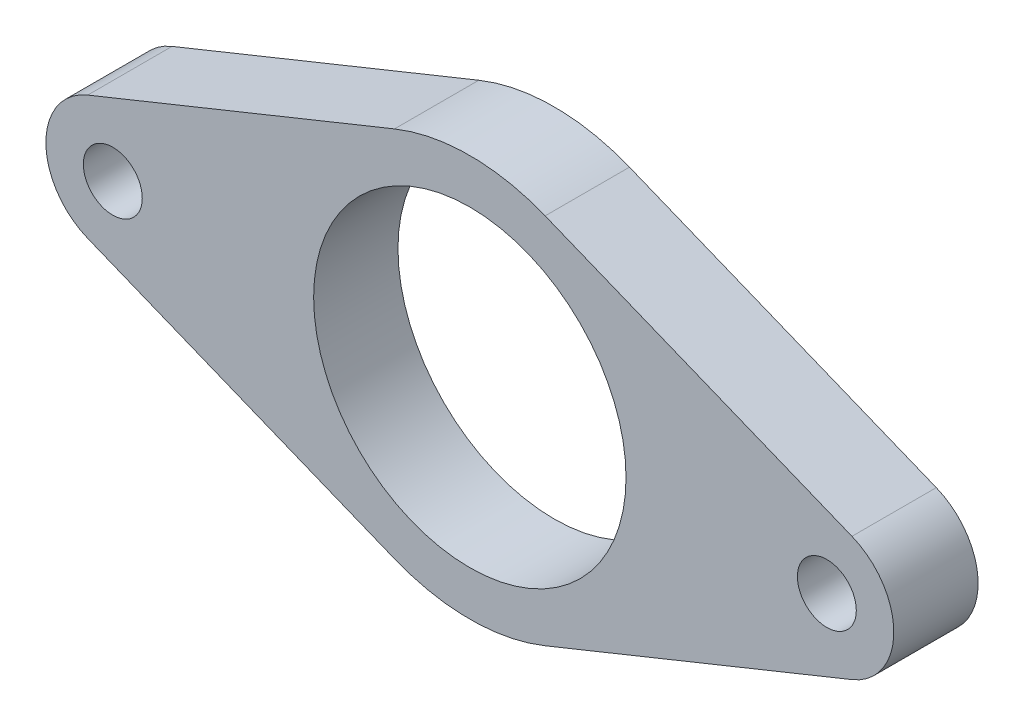
ISO-10303-21;
HEADER;
FILE_DESCRIPTION(('STEP AP214'),'2;1');
FILE_NAME('part.step','',(''),(''),'','','');
FILE_SCHEMA(('AUTOMOTIVE_DESIGN { 1 0 10303 214 1 1 1 1 }'));
ENDSEC;
DATA;
#1=APPLICATION_CONTEXT('core data for automotive mechanical design processes');
#2=APPLICATION_PROTOCOL_DEFINITION('international standard','automotive_design',2000,#1);
#3=PRODUCT_CONTEXT('',#1,'mechanical');
#4=PRODUCT('Part','Part','',(#3));
#5=PRODUCT_RELATED_PRODUCT_CATEGORY('part','',(#4));
#6=PRODUCT_DEFINITION_FORMATION('','',#4);
#7=PRODUCT_DEFINITION_CONTEXT('part definition',#1,'design');
#8=PRODUCT_DEFINITION('design','',#6,#7);
#9=PRODUCT_DEFINITION_SHAPE('','',#8);
#10=(LENGTH_UNIT() NAMED_UNIT(*) SI_UNIT(.MILLI.,.METRE.));
#11=(NAMED_UNIT(*) PLANE_ANGLE_UNIT() SI_UNIT($,.RADIAN.));
#12=(NAMED_UNIT(*) SI_UNIT($,.STERADIAN.) SOLID_ANGLE_UNIT());
#13=UNCERTAINTY_MEASURE_WITH_UNIT(LENGTH_MEASURE(1.E-05),#10,'distance_accuracy_value','');
#14=(GEOMETRIC_REPRESENTATION_CONTEXT(3) GLOBAL_UNCERTAINTY_ASSIGNED_CONTEXT((#13)) GLOBAL_UNIT_ASSIGNED_CONTEXT((#10,
#11,#12)) REPRESENTATION_CONTEXT('',''));
#15=CARTESIAN_POINT('',(0.,0.,0.));
#16=DIRECTION('',(0.,0.,1.));
#17=DIRECTION('',(1.,0.,0.));
#18=AXIS2_PLACEMENT_3D('',#15,#16,#17);
#19=CARTESIAN_POINT('',(0.,0.,3.));
#20=DIRECTION('',(0.,0.,1.));
#21=DIRECTION('',(1.,0.,0.));
#22=AXIS2_PLACEMENT_3D('',#19,#20,#21);
#23=PLANE('',#22);
#24=CARTESIAN_POINT('',(0.,0.,3.));
#25=DIRECTION('',(0.,0.,-1.));
#26=DIRECTION('',(-1.,0.,0.));
#27=AXIS2_PLACEMENT_3D('',#24,#25,#26);
#28=CIRCLE('',#27,11.1125);
#29=CARTESIAN_POINT('',(-11.1125,0.,3.));
#30=VERTEX_POINT('',#29);
#31=EDGE_CURVE('E137',#30,#30,#28,.T.);
#32=ORIENTED_EDGE('',*,*,#31,.T.);
#33=EDGE_LOOP('',(#32));
#34=FACE_BOUND('',#33,.T.);
#35=DIRECTION('',(-0.927024810886958,0.375,0.));
#36=VECTOR('',#35,1.);
#37=CARTESIAN_POINT('',(-5.3578125,-13.2448669855474,3.));
#38=LINE('',#37,#36);
#39=CARTESIAN_POINT('',(-27.1859375,-4.41495566184915,3.));
#40=VERTEX_POINT('',#39);
#41=CARTESIAN_POINT('',(-5.3578125,-13.2448669855474,3.));
#42=VERTEX_POINT('',#41);
#43=EDGE_CURVE('E110',#40,#42,#38,.F.);
#44=ORIENTED_EDGE('',*,*,#43,.T.);
#45=CARTESIAN_POINT('',(0.,0.,3.));
#46=DIRECTION('',(0.,0.,-1.));
#47=DIRECTION('',(-1.,0.,0.));
#48=AXIS2_PLACEMENT_3D('',#45,#46,#47);
#49=CIRCLE('',#48,14.2875);
#50=CARTESIAN_POINT('',(5.35781250000001,-13.2448669855474,3.));
#51=VERTEX_POINT('',#50);
#52=EDGE_CURVE('E112',#51,#42,#49,.T.);
#53=ORIENTED_EDGE('',*,*,#52,.F.);
#54=DIRECTION('',(-0.927024810886958,-0.375,0.));
#55=VECTOR('',#54,1.);
#56=CARTESIAN_POINT('',(5.35781250000001,-13.2448669855474,3.));
#57=LINE('',#56,#55);
#58=CARTESIAN_POINT('',(27.1859375,-4.41495566184913,3.));
#59=VERTEX_POINT('',#58);
#60=EDGE_CURVE('E86',#51,#59,#57,.F.);
#61=ORIENTED_EDGE('',*,*,#60,.T.);
#62=CARTESIAN_POINT('',(25.4,0.,3.));
#63=DIRECTION('',(0.,0.,-1.));
#64=DIRECTION('',(-1.,0.,0.));
#65=AXIS2_PLACEMENT_3D('',#62,#63,#64);
#66=CIRCLE('',#65,4.7625);
#67=CARTESIAN_POINT('',(27.1859375,4.41495566184915,3.));
#68=VERTEX_POINT('',#67);
#69=EDGE_CURVE('E80',#68,#59,#66,.T.);
#70=ORIENTED_EDGE('',*,*,#69,.F.);
#71=DIRECTION('',(0.927024810886958,-0.375,0.));
#72=VECTOR('',#71,1.);
#73=CARTESIAN_POINT('',(5.3578125,13.2448669855474,3.));
#74=LINE('',#73,#72);
#75=CARTESIAN_POINT('',(5.35781249999999,13.2448669855474,3.));
#76=VERTEX_POINT('',#75);
#77=EDGE_CURVE('E84',#68,#76,#74,.F.);
#78=ORIENTED_EDGE('',*,*,#77,.T.);
#79=CARTESIAN_POINT('',(0.,0.,3.));
#80=DIRECTION('',(0.,0.,-1.));
#81=DIRECTION('',(-1.,0.,0.));
#82=AXIS2_PLACEMENT_3D('',#79,#80,#81);
#83=CIRCLE('',#82,14.2875);
#84=CARTESIAN_POINT('',(-5.3578125,13.2448669855474,3.));
#85=VERTEX_POINT('',#84);
#86=EDGE_CURVE('E99',#85,#76,#83,.T.);
#87=ORIENTED_EDGE('',*,*,#86,.F.);
#88=DIRECTION('',(0.927024810886958,0.375,0.));
#89=VECTOR('',#88,1.);
#90=CARTESIAN_POINT('',(-5.3578125,13.2448669855474,3.));
#91=LINE('',#90,#89);
#92=CARTESIAN_POINT('',(-27.1859375,4.41495566184913,3.));
#93=VERTEX_POINT('',#92);
#94=EDGE_CURVE('E114',#85,#93,#91,.F.);
#95=ORIENTED_EDGE('',*,*,#94,.T.);
#96=CARTESIAN_POINT('',(-25.4,0.,3.));
#97=DIRECTION('',(0.,0.,-1.));
#98=DIRECTION('',(-1.,0.,0.));
#99=AXIS2_PLACEMENT_3D('',#96,#97,#98);
#100=CIRCLE('',#99,4.7625);
#101=EDGE_CURVE('E142',#40,#93,#100,.T.);
#102=ORIENTED_EDGE('',*,*,#101,.F.);
#103=EDGE_LOOP('',(#44,#53,#61,#70,#78,#87,#95,#102));
#104=FACE_BOUND('',#103,.T.);
#105=CARTESIAN_POINT('',(25.4,0.,3.));
#106=DIRECTION('',(0.,0.,1.));
#107=DIRECTION('',(1.,0.,0.));
#108=AXIS2_PLACEMENT_3D('',#105,#106,#107);
#109=CIRCLE('',#108,2.09549999999999);
#110=CARTESIAN_POINT('',(27.4955,0.,3.));
#111=VERTEX_POINT('',#110);
#112=EDGE_CURVE('E92',#111,#111,#109,.F.);
#113=ORIENTED_EDGE('',*,*,#112,.T.);
#114=EDGE_LOOP('',(#113));
#115=FACE_BOUND('',#114,.T.);
#116=CARTESIAN_POINT('',(-25.4,0.,3.));
#117=DIRECTION('',(0.,0.,1.));
#118=DIRECTION('',(1.,0.,0.));
#119=AXIS2_PLACEMENT_3D('',#116,#117,#118);
#120=CIRCLE('',#119,2.09549999999999);
#121=CARTESIAN_POINT('',(-23.3045,0.,3.));
#122=VERTEX_POINT('',#121);
#123=EDGE_CURVE('E19',#122,#122,#120,.F.);
#124=ORIENTED_EDGE('',*,*,#123,.T.);
#125=EDGE_LOOP('',(#124));
#126=FACE_BOUND('',#125,.T.);
#127=ADVANCED_FACE('F16',(#34,#104,#115,#126),#23,.T.);
#128=CARTESIAN_POINT('',(-25.4,0.,3.));
#129=DIRECTION('',(0.,0.,1.));
#130=DIRECTION('',(1.,0.,0.));
#131=AXIS2_PLACEMENT_3D('',#128,#129,#130);
#132=CYLINDRICAL_SURFACE('',#131,2.09549999999999);
#133=CARTESIAN_POINT('',(-25.4,0.,-3.));
#134=DIRECTION('',(0.,0.,1.));
#135=DIRECTION('',(1.,0.,0.));
#136=AXIS2_PLACEMENT_3D('',#133,#134,#135);
#137=CIRCLE('',#136,2.09549999999999);
#138=CARTESIAN_POINT('',(-23.3045,0.,-3.));
#139=VERTEX_POINT('',#138);
#140=EDGE_CURVE('E134',#139,#139,#137,.F.);
#141=ORIENTED_EDGE('',*,*,#140,.T.);
#142=EDGE_LOOP('',(#141));
#143=FACE_BOUND('',#142,.T.);
#144=ORIENTED_EDGE('',*,*,#123,.F.);
#145=EDGE_LOOP('',(#144));
#146=FACE_BOUND('',#145,.T.);
#147=ADVANCED_FACE('F150',(#143,#146),#132,.F.);
#148=CARTESIAN_POINT('',(25.4,0.,3.));
#149=DIRECTION('',(0.,0.,1.));
#150=DIRECTION('',(1.,0.,0.));
#151=AXIS2_PLACEMENT_3D('',#148,#149,#150);
#152=CYLINDRICAL_SURFACE('',#151,2.09549999999999);
#153=CARTESIAN_POINT('',(25.4,0.,-3.));
#154=DIRECTION('',(0.,0.,1.));
#155=DIRECTION('',(1.,0.,0.));
#156=AXIS2_PLACEMENT_3D('',#153,#154,#155);
#157=CIRCLE('',#156,2.09549999999999);
#158=CARTESIAN_POINT('',(27.4955,0.,-3.));
#159=VERTEX_POINT('',#158);
#160=EDGE_CURVE('E131',#159,#159,#157,.F.);
#161=ORIENTED_EDGE('',*,*,#160,.T.);
#162=EDGE_LOOP('',(#161));
#163=FACE_BOUND('',#162,.T.);
#164=ORIENTED_EDGE('',*,*,#112,.F.);
#165=EDGE_LOOP('',(#164));
#166=FACE_BOUND('',#165,.T.);
#167=ADVANCED_FACE('F152',(#163,#166),#152,.F.);
#168=CARTESIAN_POINT('',(25.4,0.,3.));
#169=DIRECTION('',(0.,0.,-1.));
#170=DIRECTION('',(-1.,0.,0.));
#171=AXIS2_PLACEMENT_3D('',#168,#169,#170);
#172=CYLINDRICAL_SURFACE('',#171,4.7625);
#173=ORIENTED_EDGE('',*,*,#69,.T.);
#174=DIRECTION('',(0.,0.,1.));
#175=VECTOR('',#174,1.);
#176=CARTESIAN_POINT('',(27.1859375,-4.41495566184913,3.));
#177=LINE('',#176,#175);
#178=CARTESIAN_POINT('',(27.1859375,-4.41495566184913,-3.));
#179=VERTEX_POINT('',#178);
#180=EDGE_CURVE('E109',#59,#179,#177,.F.);
#181=ORIENTED_EDGE('',*,*,#180,.T.);
#182=CARTESIAN_POINT('',(25.4,0.,-3.));
#183=DIRECTION('',(0.,0.,-1.));
#184=DIRECTION('',(-1.,0.,0.));
#185=AXIS2_PLACEMENT_3D('',#182,#183,#184);
#186=CIRCLE('',#185,4.7625);
#187=CARTESIAN_POINT('',(27.1859375,4.41495566184915,-3.));
#188=VERTEX_POINT('',#187);
#189=EDGE_CURVE('E103',#179,#188,#186,.F.);
#190=ORIENTED_EDGE('',*,*,#189,.T.);
#191=DIRECTION('',(0.,0.,1.));
#192=VECTOR('',#191,1.);
#193=CARTESIAN_POINT('',(27.1859375,4.41495566184915,3.));
#194=LINE('',#193,#192);
#195=EDGE_CURVE('E91',#188,#68,#194,.T.);
#196=ORIENTED_EDGE('',*,*,#195,.T.);
#197=EDGE_LOOP('',(#173,#181,#190,#196));
#198=FACE_BOUND('',#197,.T.);
#199=ADVANCED_FACE('F102',(#198),#172,.T.);
#200=CARTESIAN_POINT('',(5.3578125,13.2448669855474,3.));
#201=DIRECTION('',(-0.375,-0.927024810886958,0.));
#202=DIRECTION('',(0.927024810886958,-0.375,0.));
#203=AXIS2_PLACEMENT_3D('',#200,#201,#202);
#204=PLANE('',#203);
#205=DIRECTION('',(0.,0.,-1.));
#206=VECTOR('',#205,1.);
#207=CARTESIAN_POINT('',(5.35781249999999,13.2448669855474,3.));
#208=LINE('',#207,#206);
#209=CARTESIAN_POINT('',(5.35781249999999,13.2448669855474,-3.));
#210=VERTEX_POINT('',#209);
#211=EDGE_CURVE('E98',#76,#210,#208,.T.);
#212=ORIENTED_EDGE('',*,*,#211,.F.);
#213=ORIENTED_EDGE('',*,*,#77,.F.);
#214=ORIENTED_EDGE('',*,*,#195,.F.);
#215=DIRECTION('',(-0.927024810886958,0.375,0.));
#216=VECTOR('',#215,1.);
#217=CARTESIAN_POINT('',(27.1859375,4.41495566184915,-3.));
#218=LINE('',#217,#216);
#219=EDGE_CURVE('E129',#188,#210,#218,.T.);
#220=ORIENTED_EDGE('',*,*,#219,.T.);
#221=EDGE_LOOP('',(#212,#213,#214,#220));
#222=FACE_BOUND('',#221,.T.);
#223=ADVANCED_FACE('F95',(#222),#204,.F.);
#224=CARTESIAN_POINT('',(0.,0.,3.));
#225=DIRECTION('',(0.,0.,-1.));
#226=DIRECTION('',(-1.,0.,0.));
#227=AXIS2_PLACEMENT_3D('',#224,#225,#226);
#228=CYLINDRICAL_SURFACE('',#227,14.2875);
#229=ORIENTED_EDGE('',*,*,#86,.T.);
#230=ORIENTED_EDGE('',*,*,#211,.T.);
#231=CARTESIAN_POINT('',(0.,0.,-3.));
#232=DIRECTION('',(0.,0.,-1.));
#233=DIRECTION('',(-1.,0.,0.));
#234=AXIS2_PLACEMENT_3D('',#231,#232,#233);
#235=CIRCLE('',#234,14.2875);
#236=CARTESIAN_POINT('',(-5.3578125,13.2448669855474,-3.));
#237=VERTEX_POINT('',#236);
#238=EDGE_CURVE('E126',#210,#237,#235,.F.);
#239=ORIENTED_EDGE('',*,*,#238,.T.);
#240=DIRECTION('',(0.,0.,1.));
#241=VECTOR('',#240,1.);
#242=CARTESIAN_POINT('',(-5.3578125,13.2448669855474,3.));
#243=LINE('',#242,#241);
#244=EDGE_CURVE('E117',#237,#85,#243,.T.);
#245=ORIENTED_EDGE('',*,*,#244,.T.);
#246=EDGE_LOOP('',(#229,#230,#239,#245));
#247=FACE_BOUND('',#246,.T.);
#248=ADVANCED_FACE('F193',(#247),#228,.T.);
#249=CARTESIAN_POINT('',(-5.3578125,13.2448669855474,3.));
#250=DIRECTION('',(0.375,-0.927024810886958,0.));
#251=DIRECTION('',(0.927024810886958,0.375,0.));
#252=AXIS2_PLACEMENT_3D('',#249,#250,#251);
#253=PLANE('',#252);
#254=DIRECTION('',(0.,0.,-1.));
#255=VECTOR('',#254,1.);
#256=CARTESIAN_POINT('',(-27.1859375,4.41495566184913,3.));
#257=LINE('',#256,#255);
#258=CARTESIAN_POINT('',(-27.1859375,4.41495566184913,-3.));
#259=VERTEX_POINT('',#258);
#260=EDGE_CURVE('E116',#93,#259,#257,.T.);
#261=ORIENTED_EDGE('',*,*,#260,.F.);
#262=ORIENTED_EDGE('',*,*,#94,.F.);
#263=ORIENTED_EDGE('',*,*,#244,.F.);
#264=DIRECTION('',(-0.927024810886958,-0.375,0.));
#265=VECTOR('',#264,1.);
#266=CARTESIAN_POINT('',(-5.3578125,13.2448669855474,-3.));
#267=LINE('',#266,#265);
#268=EDGE_CURVE('E125',#237,#259,#267,.T.);
#269=ORIENTED_EDGE('',*,*,#268,.T.);
#270=EDGE_LOOP('',(#261,#262,#263,#269));
#271=FACE_BOUND('',#270,.T.);
#272=ADVANCED_FACE('F189',(#271),#253,.F.);
#273=CARTESIAN_POINT('',(-25.4,0.,3.));
#274=DIRECTION('',(0.,0.,-1.));
#275=DIRECTION('',(-1.,0.,0.));
#276=AXIS2_PLACEMENT_3D('',#273,#274,#275);
#277=CYLINDRICAL_SURFACE('',#276,4.7625);
#278=CARTESIAN_POINT('',(-25.4,0.,-3.));
#279=DIRECTION('',(0.,0.,-1.));
#280=DIRECTION('',(-1.,0.,0.));
#281=AXIS2_PLACEMENT_3D('',#278,#279,#280);
#282=CIRCLE('',#281,4.7625);
#283=CARTESIAN_POINT('',(-27.1859375,-4.41495566184915,-3.));
#284=VERTEX_POINT('',#283);
#285=EDGE_CURVE('E123',#259,#284,#282,.F.);
#286=ORIENTED_EDGE('',*,*,#285,.T.);
#287=DIRECTION('',(0.,0.,1.));
#288=VECTOR('',#287,1.);
#289=CARTESIAN_POINT('',(-27.1859375,-4.41495566184915,3.));
#290=LINE('',#289,#288);
#291=EDGE_CURVE('E113',#284,#40,#290,.T.);
#292=ORIENTED_EDGE('',*,*,#291,.T.);
#293=ORIENTED_EDGE('',*,*,#101,.T.);
#294=ORIENTED_EDGE('',*,*,#260,.T.);
#295=EDGE_LOOP('',(#286,#292,#293,#294));
#296=FACE_BOUND('',#295,.T.);
#297=ADVANCED_FACE('F185',(#296),#277,.T.);
#298=CARTESIAN_POINT('',(-5.3578125,-13.2448669855474,3.));
#299=DIRECTION('',(0.375,0.927024810886958,0.));
#300=DIRECTION('',(-0.927024810886958,0.375,0.));
#301=AXIS2_PLACEMENT_3D('',#298,#299,#300);
#302=PLANE('',#301);
#303=DIRECTION('',(0.,0.,-1.));
#304=VECTOR('',#303,1.);
#305=CARTESIAN_POINT('',(-5.3578125,-13.2448669855474,3.));
#306=LINE('',#305,#304);
#307=CARTESIAN_POINT('',(-5.3578125,-13.2448669855474,-3.));
#308=VERTEX_POINT('',#307);
#309=EDGE_CURVE('E141',#42,#308,#306,.T.);
#310=ORIENTED_EDGE('',*,*,#309,.F.);
#311=ORIENTED_EDGE('',*,*,#43,.F.);
#312=ORIENTED_EDGE('',*,*,#291,.F.);
#313=DIRECTION('',(0.927024810886958,-0.375,0.));
#314=VECTOR('',#313,1.);
#315=CARTESIAN_POINT('',(-27.1859375,-4.41495566184915,-3.));
#316=LINE('',#315,#314);
#317=EDGE_CURVE('E122',#284,#308,#316,.T.);
#318=ORIENTED_EDGE('',*,*,#317,.T.);
#319=EDGE_LOOP('',(#310,#311,#312,#318));
#320=FACE_BOUND('',#319,.T.);
#321=ADVANCED_FACE('F181',(#320),#302,.F.);
#322=CARTESIAN_POINT('',(0.,0.,3.));
#323=DIRECTION('',(0.,0.,-1.));
#324=DIRECTION('',(-1.,0.,0.));
#325=AXIS2_PLACEMENT_3D('',#322,#323,#324);
#326=CYLINDRICAL_SURFACE('',#325,14.2875);
#327=ORIENTED_EDGE('',*,*,#52,.T.);
#328=ORIENTED_EDGE('',*,*,#309,.T.);
#329=CARTESIAN_POINT('',(0.,0.,-3.));
#330=DIRECTION('',(0.,0.,-1.));
#331=DIRECTION('',(-1.,0.,0.));
#332=AXIS2_PLACEMENT_3D('',#329,#330,#331);
#333=CIRCLE('',#332,14.2875);
#334=CARTESIAN_POINT('',(5.35781250000001,-13.2448669855474,-3.));
#335=VERTEX_POINT('',#334);
#336=EDGE_CURVE('E119',#308,#335,#333,.F.);
#337=ORIENTED_EDGE('',*,*,#336,.T.);
#338=DIRECTION('',(0.,0.,1.));
#339=VECTOR('',#338,1.);
#340=CARTESIAN_POINT('',(5.35781250000001,-13.2448669855474,3.));
#341=LINE('',#340,#339);
#342=EDGE_CURVE('E34',#335,#51,#341,.T.);
#343=ORIENTED_EDGE('',*,*,#342,.T.);
#344=EDGE_LOOP('',(#327,#328,#337,#343));
#345=FACE_BOUND('',#344,.T.);
#346=ADVANCED_FACE('F178',(#345),#326,.T.);
#347=CARTESIAN_POINT('',(5.35781250000001,-13.2448669855474,3.));
#348=DIRECTION('',(-0.375,0.927024810886958,0.));
#349=DIRECTION('',(-0.927024810886958,-0.375,0.));
#350=AXIS2_PLACEMENT_3D('',#347,#348,#349);
#351=PLANE('',#350);
#352=ORIENTED_EDGE('',*,*,#180,.F.);
#353=ORIENTED_EDGE('',*,*,#60,.F.);
#354=ORIENTED_EDGE('',*,*,#342,.F.);
#355=DIRECTION('',(0.927024810886958,0.375,0.));
#356=VECTOR('',#355,1.);
#357=CARTESIAN_POINT('',(5.35781250000001,-13.2448669855474,-3.));
#358=LINE('',#357,#356);
#359=EDGE_CURVE('E25',#335,#179,#358,.T.);
#360=ORIENTED_EDGE('',*,*,#359,.T.);
#361=EDGE_LOOP('',(#352,#353,#354,#360));
#362=FACE_BOUND('',#361,.T.);
#363=ADVANCED_FACE('F170',(#362),#351,.F.);
#364=CARTESIAN_POINT('',(0.,0.,3.));
#365=DIRECTION('',(0.,0.,-1.));
#366=DIRECTION('',(-1.,0.,0.));
#367=AXIS2_PLACEMENT_3D('',#364,#365,#366);
#368=CYLINDRICAL_SURFACE('',#367,11.1125);
#369=CARTESIAN_POINT('',(0.,0.,-3.));
#370=DIRECTION('',(0.,0.,-1.));
#371=DIRECTION('',(-1.,0.,0.));
#372=AXIS2_PLACEMENT_3D('',#369,#370,#371);
#373=CIRCLE('',#372,11.1125);
#374=CARTESIAN_POINT('',(-11.1125,0.,-3.));
#375=VERTEX_POINT('',#374);
#376=EDGE_CURVE('E9',#375,#375,#373,.T.);
#377=ORIENTED_EDGE('',*,*,#376,.T.);
#378=EDGE_LOOP('',(#377));
#379=FACE_BOUND('',#378,.T.);
#380=ORIENTED_EDGE('',*,*,#31,.F.);
#381=EDGE_LOOP('',(#380));
#382=FACE_BOUND('',#381,.T.);
#383=ADVANCED_FACE('F164',(#379,#382),#368,.F.);
#384=CARTESIAN_POINT('',(0.,0.,-3.));
#385=DIRECTION('',(0.,0.,1.));
#386=DIRECTION('',(1.,0.,0.));
#387=AXIS2_PLACEMENT_3D('',#384,#385,#386);
#388=PLANE('',#387);
#389=ORIENTED_EDGE('',*,*,#376,.F.);
#390=EDGE_LOOP('',(#389));
#391=FACE_BOUND('',#390,.T.);
#392=ORIENTED_EDGE('',*,*,#336,.F.);
#393=ORIENTED_EDGE('',*,*,#317,.F.);
#394=ORIENTED_EDGE('',*,*,#285,.F.);
#395=ORIENTED_EDGE('',*,*,#268,.F.);
#396=ORIENTED_EDGE('',*,*,#238,.F.);
#397=ORIENTED_EDGE('',*,*,#219,.F.);
#398=ORIENTED_EDGE('',*,*,#189,.F.);
#399=ORIENTED_EDGE('',*,*,#359,.F.);
#400=EDGE_LOOP('',(#392,#393,#394,#395,#396,#397,#398,#399));
#401=FACE_BOUND('',#400,.T.);
#402=ORIENTED_EDGE('',*,*,#160,.F.);
#403=EDGE_LOOP('',(#402));
#404=FACE_BOUND('',#403,.T.);
#405=ORIENTED_EDGE('',*,*,#140,.F.);
#406=EDGE_LOOP('',(#405));
#407=FACE_BOUND('',#406,.T.);
#408=ADVANCED_FACE('F162',(#391,#401,#404,#407),#388,.F.);
#409=CLOSED_SHELL('',(#127,#147,#167,#199,#223,#248,#272,#297,#321,#346,#363,#383,#408));
#410=MANIFOLD_SOLID_BREP('B1',#409);
#411=ADVANCED_BREP_SHAPE_REPRESENTATION('',(#18,#410),#14);
#412=SHAPE_DEFINITION_REPRESENTATION(#9,#411);
ENDSEC;
END-ISO-10303-21;
